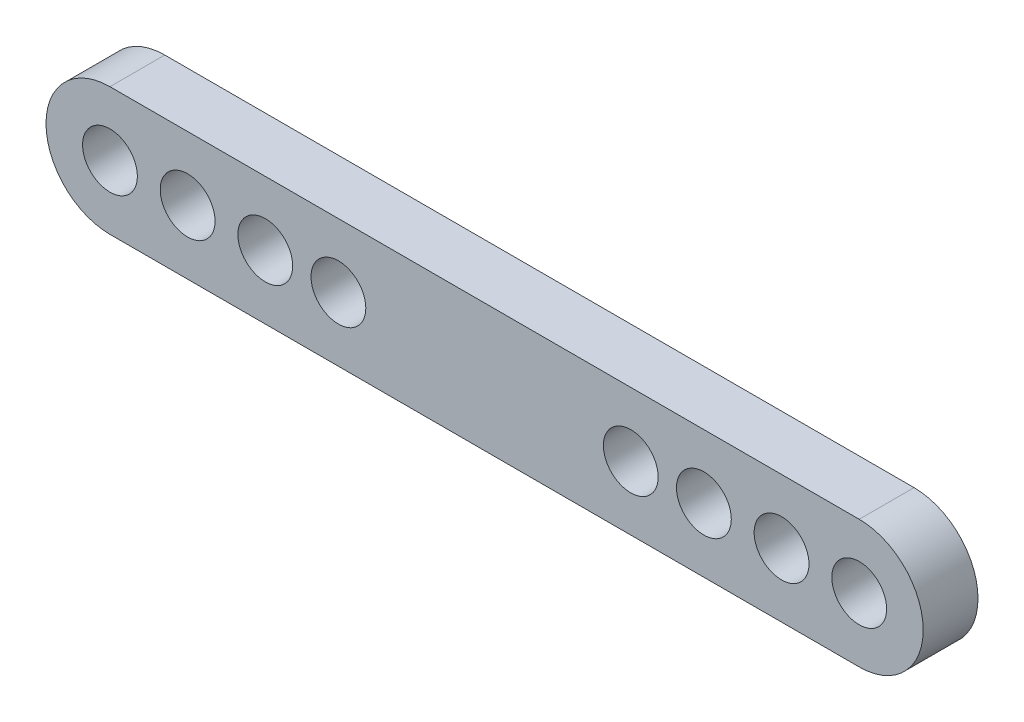
ISO-10303-21;
HEADER;
FILE_DESCRIPTION(('STEP AP214'),'2;1');
FILE_NAME('part.step','',(''),(''),'','','');
FILE_SCHEMA(('AUTOMOTIVE_DESIGN { 1 0 10303 214 1 1 1 1 }'));
ENDSEC;
DATA;
#1=APPLICATION_CONTEXT('core data for automotive mechanical design processes');
#2=APPLICATION_PROTOCOL_DEFINITION('international standard','automotive_design',2000,#1);
#3=PRODUCT_CONTEXT('',#1,'mechanical');
#4=PRODUCT('Part','Part','',(#3));
#5=PRODUCT_RELATED_PRODUCT_CATEGORY('part','',(#4));
#6=PRODUCT_DEFINITION_FORMATION('','',#4);
#7=PRODUCT_DEFINITION_CONTEXT('part definition',#1,'design');
#8=PRODUCT_DEFINITION('design','',#6,#7);
#9=PRODUCT_DEFINITION_SHAPE('','',#8);
#10=(LENGTH_UNIT() NAMED_UNIT(*) SI_UNIT(.MILLI.,.METRE.));
#11=(NAMED_UNIT(*) PLANE_ANGLE_UNIT() SI_UNIT($,.RADIAN.));
#12=(NAMED_UNIT(*) SI_UNIT($,.STERADIAN.) SOLID_ANGLE_UNIT());
#13=UNCERTAINTY_MEASURE_WITH_UNIT(LENGTH_MEASURE(1.E-05),#10,'distance_accuracy_value','');
#14=(GEOMETRIC_REPRESENTATION_CONTEXT(3) GLOBAL_UNCERTAINTY_ASSIGNED_CONTEXT((#13)) GLOBAL_UNIT_ASSIGNED_CONTEXT((#10,
#11,#12)) REPRESENTATION_CONTEXT('',''));
#15=CARTESIAN_POINT('',(0.,0.,0.));
#16=DIRECTION('',(0.,0.,1.));
#17=DIRECTION('',(1.,0.,0.));
#18=AXIS2_PLACEMENT_3D('',#15,#16,#17);
#19=CARTESIAN_POINT('',(-20.5,0.,3.));
#20=DIRECTION('',(0.,0.,-1.));
#21=DIRECTION('',(-1.,0.,0.));
#22=AXIS2_PLACEMENT_3D('',#19,#20,#21);
#23=PLANE('',#22);
#24=CARTESIAN_POINT('',(-20.5,0.,3.));
#25=DIRECTION('',(0.,0.,1.));
#26=DIRECTION('',(-1.,0.,0.));
#27=AXIS2_PLACEMENT_3D('',#24,#25,#26);
#28=CIRCLE('',#27,3.5);
#29=CARTESIAN_POINT('',(-20.5,3.5,3.));
#30=VERTEX_POINT('',#29);
#31=CARTESIAN_POINT('',(-20.5,-3.5,3.));
#32=VERTEX_POINT('',#31);
#33=EDGE_CURVE('E86',#30,#32,#28,.T.);
#34=ORIENTED_EDGE('',*,*,#33,.T.);
#35=DIRECTION('',(1.,0.,0.));
#36=VECTOR('',#35,1.);
#37=CARTESIAN_POINT('',(-20.5,-3.5,3.));
#38=LINE('',#37,#36);
#39=CARTESIAN_POINT('',(20.5,-3.49999999999999,3.));
#40=VERTEX_POINT('',#39);
#41=EDGE_CURVE('E81',#32,#40,#38,.T.);
#42=ORIENTED_EDGE('',*,*,#41,.T.);
#43=CARTESIAN_POINT('',(20.5,0.,3.));
#44=DIRECTION('',(0.,0.,1.));
#45=DIRECTION('',(1.,0.,0.));
#46=AXIS2_PLACEMENT_3D('',#43,#44,#45);
#47=CIRCLE('',#46,3.5);
#48=CARTESIAN_POINT('',(20.5,3.50000000000001,3.));
#49=VERTEX_POINT('',#48);
#50=EDGE_CURVE('E84',#40,#49,#47,.T.);
#51=ORIENTED_EDGE('',*,*,#50,.T.);
#52=DIRECTION('',(-1.,0.,0.));
#53=VECTOR('',#52,1.);
#54=CARTESIAN_POINT('',(-20.5,3.5,3.));
#55=LINE('',#54,#53);
#56=EDGE_CURVE('E51',#49,#30,#55,.T.);
#57=ORIENTED_EDGE('',*,*,#56,.T.);
#58=EDGE_LOOP('',(#34,#42,#51,#57));
#59=FACE_BOUND('',#58,.T.);
#60=CARTESIAN_POINT('',(-20.5,0.,3.));
#61=DIRECTION('',(0.,0.,1.));
#62=DIRECTION('',(1.,0.,0.));
#63=AXIS2_PLACEMENT_3D('',#60,#61,#62);
#64=CIRCLE('',#63,1.5);
#65=CARTESIAN_POINT('',(-19.,0.,3.));
#66=VERTEX_POINT('',#65);
#67=EDGE_CURVE('E101',#66,#66,#64,.T.);
#68=ORIENTED_EDGE('',*,*,#67,.F.);
#69=EDGE_LOOP('',(#68));
#70=FACE_BOUND('',#69,.T.);
#71=CARTESIAN_POINT('',(-16.25,0.,3.));
#72=DIRECTION('',(0.,0.,1.));
#73=DIRECTION('',(1.,0.,0.));
#74=AXIS2_PLACEMENT_3D('',#71,#72,#73);
#75=CIRCLE('',#74,1.5);
#76=CARTESIAN_POINT('',(-14.75,0.,3.));
#77=VERTEX_POINT('',#76);
#78=EDGE_CURVE('E116',#77,#77,#75,.T.);
#79=ORIENTED_EDGE('',*,*,#78,.F.);
#80=EDGE_LOOP('',(#79));
#81=FACE_BOUND('',#80,.T.);
#82=CARTESIAN_POINT('',(-12.,0.,3.));
#83=DIRECTION('',(0.,0.,1.));
#84=DIRECTION('',(1.,0.,0.));
#85=AXIS2_PLACEMENT_3D('',#82,#83,#84);
#86=CIRCLE('',#85,1.5);
#87=CARTESIAN_POINT('',(-10.5,0.,3.));
#88=VERTEX_POINT('',#87);
#89=EDGE_CURVE('E122',#88,#88,#86,.T.);
#90=ORIENTED_EDGE('',*,*,#89,.F.);
#91=EDGE_LOOP('',(#90));
#92=FACE_BOUND('',#91,.T.);
#93=CARTESIAN_POINT('',(-8.,0.,3.));
#94=DIRECTION('',(0.,0.,1.));
#95=DIRECTION('',(1.,0.,0.));
#96=AXIS2_PLACEMENT_3D('',#93,#94,#95);
#97=CIRCLE('',#96,1.5);
#98=CARTESIAN_POINT('',(-6.5,0.,3.));
#99=VERTEX_POINT('',#98);
#100=EDGE_CURVE('E128',#99,#99,#97,.T.);
#101=ORIENTED_EDGE('',*,*,#100,.F.);
#102=EDGE_LOOP('',(#101));
#103=FACE_BOUND('',#102,.T.);
#104=CARTESIAN_POINT('',(8.,0.,3.));
#105=DIRECTION('',(0.,0.,1.));
#106=DIRECTION('',(1.,0.,0.));
#107=AXIS2_PLACEMENT_3D('',#104,#105,#106);
#108=CIRCLE('',#107,1.5);
#109=CARTESIAN_POINT('',(9.50000000000001,0.,3.));
#110=VERTEX_POINT('',#109);
#111=EDGE_CURVE('E134',#110,#110,#108,.T.);
#112=ORIENTED_EDGE('',*,*,#111,.F.);
#113=EDGE_LOOP('',(#112));
#114=FACE_BOUND('',#113,.T.);
#115=CARTESIAN_POINT('',(12.,0.,3.));
#116=DIRECTION('',(0.,0.,1.));
#117=DIRECTION('',(1.,0.,0.));
#118=AXIS2_PLACEMENT_3D('',#115,#116,#117);
#119=CIRCLE('',#118,1.5);
#120=CARTESIAN_POINT('',(13.5,0.,3.));
#121=VERTEX_POINT('',#120);
#122=EDGE_CURVE('E140',#121,#121,#119,.T.);
#123=ORIENTED_EDGE('',*,*,#122,.F.);
#124=EDGE_LOOP('',(#123));
#125=FACE_BOUND('',#124,.T.);
#126=CARTESIAN_POINT('',(16.25,0.,3.));
#127=DIRECTION('',(0.,0.,1.));
#128=DIRECTION('',(1.,0.,0.));
#129=AXIS2_PLACEMENT_3D('',#126,#127,#128);
#130=CIRCLE('',#129,1.5);
#131=CARTESIAN_POINT('',(17.75,0.,3.));
#132=VERTEX_POINT('',#131);
#133=EDGE_CURVE('E146',#132,#132,#130,.T.);
#134=ORIENTED_EDGE('',*,*,#133,.F.);
#135=EDGE_LOOP('',(#134));
#136=FACE_BOUND('',#135,.T.);
#137=CARTESIAN_POINT('',(20.5,0.,3.));
#138=DIRECTION('',(0.,0.,1.));
#139=DIRECTION('',(1.,0.,0.));
#140=AXIS2_PLACEMENT_3D('',#137,#138,#139);
#141=CIRCLE('',#140,1.5);
#142=CARTESIAN_POINT('',(22.,0.,3.));
#143=VERTEX_POINT('',#142);
#144=EDGE_CURVE('E152',#143,#143,#141,.T.);
#145=ORIENTED_EDGE('',*,*,#144,.F.);
#146=EDGE_LOOP('',(#145));
#147=FACE_BOUND('',#146,.T.);
#148=ADVANCED_FACE('F34',(#59,#70,#81,#92,#103,#114,#125,#136,#147),#23,.F.);
#149=CARTESIAN_POINT('',(-20.5,0.,0.));
#150=DIRECTION('',(0.,0.,-1.));
#151=DIRECTION('',(-1.,0.,0.));
#152=AXIS2_PLACEMENT_3D('',#149,#150,#151);
#153=PLANE('',#152);
#154=CARTESIAN_POINT('',(16.25,0.,0.));
#155=DIRECTION('',(0.,0.,1.));
#156=DIRECTION('',(1.,0.,0.));
#157=AXIS2_PLACEMENT_3D('',#154,#155,#156);
#158=CIRCLE('',#157,1.5);
#159=CARTESIAN_POINT('',(17.75,0.,0.));
#160=VERTEX_POINT('',#159);
#161=EDGE_CURVE('E149',#160,#160,#158,.T.);
#162=ORIENTED_EDGE('',*,*,#161,.T.);
#163=EDGE_LOOP('',(#162));
#164=FACE_BOUND('',#163,.T.);
#165=CARTESIAN_POINT('',(8.,0.,0.));
#166=DIRECTION('',(0.,0.,1.));
#167=DIRECTION('',(1.,0.,0.));
#168=AXIS2_PLACEMENT_3D('',#165,#166,#167);
#169=CIRCLE('',#168,1.5);
#170=CARTESIAN_POINT('',(9.50000000000001,0.,0.));
#171=VERTEX_POINT('',#170);
#172=EDGE_CURVE('E137',#171,#171,#169,.T.);
#173=ORIENTED_EDGE('',*,*,#172,.T.);
#174=EDGE_LOOP('',(#173));
#175=FACE_BOUND('',#174,.T.);
#176=CARTESIAN_POINT('',(-12.,0.,0.));
#177=DIRECTION('',(0.,0.,1.));
#178=DIRECTION('',(1.,0.,0.));
#179=AXIS2_PLACEMENT_3D('',#176,#177,#178);
#180=CIRCLE('',#179,1.5);
#181=CARTESIAN_POINT('',(-10.5,0.,0.));
#182=VERTEX_POINT('',#181);
#183=EDGE_CURVE('E125',#182,#182,#180,.T.);
#184=ORIENTED_EDGE('',*,*,#183,.T.);
#185=EDGE_LOOP('',(#184));
#186=FACE_BOUND('',#185,.T.);
#187=CARTESIAN_POINT('',(-20.5,0.,0.));
#188=DIRECTION('',(0.,0.,1.));
#189=DIRECTION('',(1.,0.,0.));
#190=AXIS2_PLACEMENT_3D('',#187,#188,#189);
#191=CIRCLE('',#190,1.5);
#192=CARTESIAN_POINT('',(-19.,0.,0.));
#193=VERTEX_POINT('',#192);
#194=EDGE_CURVE('E113',#193,#193,#191,.T.);
#195=ORIENTED_EDGE('',*,*,#194,.T.);
#196=EDGE_LOOP('',(#195));
#197=FACE_BOUND('',#196,.T.);
#198=CARTESIAN_POINT('',(-20.5,0.,0.));
#199=DIRECTION('',(0.,0.,1.));
#200=DIRECTION('',(-1.,0.,0.));
#201=AXIS2_PLACEMENT_3D('',#198,#199,#200);
#202=CIRCLE('',#201,3.5);
#203=CARTESIAN_POINT('',(-20.5,3.5,0.));
#204=VERTEX_POINT('',#203);
#205=CARTESIAN_POINT('',(-20.5,-3.5,0.));
#206=VERTEX_POINT('',#205);
#207=EDGE_CURVE('E98',#204,#206,#202,.T.);
#208=ORIENTED_EDGE('',*,*,#207,.F.);
#209=DIRECTION('',(-1.,0.,0.));
#210=VECTOR('',#209,1.);
#211=CARTESIAN_POINT('',(-20.5,3.5,0.));
#212=LINE('',#211,#210);
#213=CARTESIAN_POINT('',(20.5,3.50000000000001,0.));
#214=VERTEX_POINT('',#213);
#215=EDGE_CURVE('E74',#214,#204,#212,.T.);
#216=ORIENTED_EDGE('',*,*,#215,.F.);
#217=CARTESIAN_POINT('',(20.5,0.,0.));
#218=DIRECTION('',(0.,0.,1.));
#219=DIRECTION('',(1.,0.,0.));
#220=AXIS2_PLACEMENT_3D('',#217,#218,#219);
#221=CIRCLE('',#220,3.5);
#222=CARTESIAN_POINT('',(20.5,-3.49999999999999,0.));
#223=VERTEX_POINT('',#222);
#224=EDGE_CURVE('E68',#223,#214,#221,.T.);
#225=ORIENTED_EDGE('',*,*,#224,.F.);
#226=DIRECTION('',(1.,0.,0.));
#227=VECTOR('',#226,1.);
#228=CARTESIAN_POINT('',(-20.5,-3.5,0.));
#229=LINE('',#228,#227);
#230=EDGE_CURVE('E90',#206,#223,#229,.T.);
#231=ORIENTED_EDGE('',*,*,#230,.F.);
#232=EDGE_LOOP('',(#208,#216,#225,#231));
#233=FACE_BOUND('',#232,.T.);
#234=CARTESIAN_POINT('',(-16.25,0.,0.));
#235=DIRECTION('',(0.,0.,1.));
#236=DIRECTION('',(1.,0.,0.));
#237=AXIS2_PLACEMENT_3D('',#234,#235,#236);
#238=CIRCLE('',#237,1.5);
#239=CARTESIAN_POINT('',(-14.75,0.,0.));
#240=VERTEX_POINT('',#239);
#241=EDGE_CURVE('E119',#240,#240,#238,.T.);
#242=ORIENTED_EDGE('',*,*,#241,.T.);
#243=EDGE_LOOP('',(#242));
#244=FACE_BOUND('',#243,.T.);
#245=CARTESIAN_POINT('',(-8.,0.,0.));
#246=DIRECTION('',(0.,0.,1.));
#247=DIRECTION('',(1.,0.,0.));
#248=AXIS2_PLACEMENT_3D('',#245,#246,#247);
#249=CIRCLE('',#248,1.5);
#250=CARTESIAN_POINT('',(-6.5,0.,0.));
#251=VERTEX_POINT('',#250);
#252=EDGE_CURVE('E131',#251,#251,#249,.T.);
#253=ORIENTED_EDGE('',*,*,#252,.T.);
#254=EDGE_LOOP('',(#253));
#255=FACE_BOUND('',#254,.T.);
#256=CARTESIAN_POINT('',(12.,0.,0.));
#257=DIRECTION('',(0.,0.,1.));
#258=DIRECTION('',(1.,0.,0.));
#259=AXIS2_PLACEMENT_3D('',#256,#257,#258);
#260=CIRCLE('',#259,1.5);
#261=CARTESIAN_POINT('',(13.5,0.,0.));
#262=VERTEX_POINT('',#261);
#263=EDGE_CURVE('E143',#262,#262,#260,.T.);
#264=ORIENTED_EDGE('',*,*,#263,.T.);
#265=EDGE_LOOP('',(#264));
#266=FACE_BOUND('',#265,.T.);
#267=CARTESIAN_POINT('',(20.5,0.,0.));
#268=DIRECTION('',(0.,0.,1.));
#269=DIRECTION('',(1.,0.,0.));
#270=AXIS2_PLACEMENT_3D('',#267,#268,#269);
#271=CIRCLE('',#270,1.5);
#272=CARTESIAN_POINT('',(22.,0.,0.));
#273=VERTEX_POINT('',#272);
#274=EDGE_CURVE('E155',#273,#273,#271,.T.);
#275=ORIENTED_EDGE('',*,*,#274,.T.);
#276=EDGE_LOOP('',(#275));
#277=FACE_BOUND('',#276,.T.);
#278=ADVANCED_FACE('F109',(#164,#175,#186,#197,#233,#244,#255,#266,#277),#153,.T.);
#279=CARTESIAN_POINT('',(-20.5,0.,3.));
#280=DIRECTION('',(0.,0.,-1.));
#281=DIRECTION('',(-1.,0.,0.));
#282=AXIS2_PLACEMENT_3D('',#279,#280,#281);
#283=CYLINDRICAL_SURFACE('',#282,3.5);
#284=ORIENTED_EDGE('',*,*,#207,.T.);
#285=DIRECTION('',(0.,0.,-1.));
#286=VECTOR('',#285,1.);
#287=CARTESIAN_POINT('',(-20.5,-3.5,3.));
#288=LINE('',#287,#286);
#289=EDGE_CURVE('E11',#32,#206,#288,.T.);
#290=ORIENTED_EDGE('',*,*,#289,.F.);
#291=ORIENTED_EDGE('',*,*,#33,.F.);
#292=DIRECTION('',(0.,0.,-1.));
#293=VECTOR('',#292,1.);
#294=CARTESIAN_POINT('',(-20.5,3.5,3.));
#295=LINE('',#294,#293);
#296=EDGE_CURVE('E94',#30,#204,#295,.T.);
#297=ORIENTED_EDGE('',*,*,#296,.T.);
#298=EDGE_LOOP('',(#284,#290,#291,#297));
#299=FACE_BOUND('',#298,.T.);
#300=ADVANCED_FACE('F36',(#299),#283,.T.);
#301=CARTESIAN_POINT('',(-20.5,-3.5,3.));
#302=DIRECTION('',(0.,1.,0.));
#303=DIRECTION('',(-1.,0.,0.));
#304=AXIS2_PLACEMENT_3D('',#301,#302,#303);
#305=PLANE('',#304);
#306=ORIENTED_EDGE('',*,*,#230,.T.);
#307=DIRECTION('',(0.,0.,-1.));
#308=VECTOR('',#307,1.);
#309=CARTESIAN_POINT('',(20.5,-3.49999999999999,3.));
#310=LINE('',#309,#308);
#311=EDGE_CURVE('E43',#40,#223,#310,.T.);
#312=ORIENTED_EDGE('',*,*,#311,.F.);
#313=ORIENTED_EDGE('',*,*,#41,.F.);
#314=ORIENTED_EDGE('',*,*,#289,.T.);
#315=EDGE_LOOP('',(#306,#312,#313,#314));
#316=FACE_BOUND('',#315,.T.);
#317=ADVANCED_FACE('F89',(#316),#305,.F.);
#318=CARTESIAN_POINT('',(20.5,0.,3.));
#319=DIRECTION('',(0.,0.,-1.));
#320=DIRECTION('',(-1.,0.,0.));
#321=AXIS2_PLACEMENT_3D('',#318,#319,#320);
#322=CYLINDRICAL_SURFACE('',#321,3.5);
#323=ORIENTED_EDGE('',*,*,#224,.T.);
#324=DIRECTION('',(0.,0.,-1.));
#325=VECTOR('',#324,1.);
#326=CARTESIAN_POINT('',(20.5,3.50000000000001,3.));
#327=LINE('',#326,#325);
#328=EDGE_CURVE('E91',#49,#214,#327,.T.);
#329=ORIENTED_EDGE('',*,*,#328,.F.);
#330=ORIENTED_EDGE('',*,*,#50,.F.);
#331=ORIENTED_EDGE('',*,*,#311,.T.);
#332=EDGE_LOOP('',(#323,#329,#330,#331));
#333=FACE_BOUND('',#332,.T.);
#334=ADVANCED_FACE('F92',(#333),#322,.T.);
#335=CARTESIAN_POINT('',(-20.5,3.5,3.));
#336=DIRECTION('',(0.,-1.,0.));
#337=DIRECTION('',(1.,0.,0.));
#338=AXIS2_PLACEMENT_3D('',#335,#336,#337);
#339=PLANE('',#338);
#340=ORIENTED_EDGE('',*,*,#215,.T.);
#341=ORIENTED_EDGE('',*,*,#296,.F.);
#342=ORIENTED_EDGE('',*,*,#56,.F.);
#343=ORIENTED_EDGE('',*,*,#328,.T.);
#344=EDGE_LOOP('',(#340,#341,#342,#343));
#345=FACE_BOUND('',#344,.T.);
#346=ADVANCED_FACE('F106',(#345),#339,.F.);
#347=CARTESIAN_POINT('',(-20.5,0.,3.));
#348=DIRECTION('',(0.,0.,-1.));
#349=DIRECTION('',(-1.,0.,0.));
#350=AXIS2_PLACEMENT_3D('',#347,#348,#349);
#351=CYLINDRICAL_SURFACE('',#350,1.5);
#352=ORIENTED_EDGE('',*,*,#67,.T.);
#353=EDGE_LOOP('',(#352));
#354=FACE_BOUND('',#353,.T.);
#355=ORIENTED_EDGE('',*,*,#194,.F.);
#356=EDGE_LOOP('',(#355));
#357=FACE_BOUND('',#356,.T.);
#358=ADVANCED_FACE('F172',(#354,#357),#351,.F.);
#359=CARTESIAN_POINT('',(-16.25,0.,3.));
#360=DIRECTION('',(0.,0.,-1.));
#361=DIRECTION('',(-1.,0.,0.));
#362=AXIS2_PLACEMENT_3D('',#359,#360,#361);
#363=CYLINDRICAL_SURFACE('',#362,1.5);
#364=ORIENTED_EDGE('',*,*,#78,.T.);
#365=EDGE_LOOP('',(#364));
#366=FACE_BOUND('',#365,.T.);
#367=ORIENTED_EDGE('',*,*,#241,.F.);
#368=EDGE_LOOP('',(#367));
#369=FACE_BOUND('',#368,.T.);
#370=ADVANCED_FACE('F218',(#366,#369),#363,.F.);
#371=CARTESIAN_POINT('',(-12.,0.,3.));
#372=DIRECTION('',(0.,0.,-1.));
#373=DIRECTION('',(-1.,0.,0.));
#374=AXIS2_PLACEMENT_3D('',#371,#372,#373);
#375=CYLINDRICAL_SURFACE('',#374,1.5);
#376=ORIENTED_EDGE('',*,*,#89,.T.);
#377=EDGE_LOOP('',(#376));
#378=FACE_BOUND('',#377,.T.);
#379=ORIENTED_EDGE('',*,*,#183,.F.);
#380=EDGE_LOOP('',(#379));
#381=FACE_BOUND('',#380,.T.);
#382=ADVANCED_FACE('F226',(#378,#381),#375,.F.);
#383=CARTESIAN_POINT('',(-8.,0.,3.));
#384=DIRECTION('',(0.,0.,-1.));
#385=DIRECTION('',(-1.,0.,0.));
#386=AXIS2_PLACEMENT_3D('',#383,#384,#385);
#387=CYLINDRICAL_SURFACE('',#386,1.5);
#388=ORIENTED_EDGE('',*,*,#100,.T.);
#389=EDGE_LOOP('',(#388));
#390=FACE_BOUND('',#389,.T.);
#391=ORIENTED_EDGE('',*,*,#252,.F.);
#392=EDGE_LOOP('',(#391));
#393=FACE_BOUND('',#392,.T.);
#394=ADVANCED_FACE('F234',(#390,#393),#387,.F.);
#395=CARTESIAN_POINT('',(8.,0.,3.));
#396=DIRECTION('',(0.,0.,-1.));
#397=DIRECTION('',(-1.,0.,0.));
#398=AXIS2_PLACEMENT_3D('',#395,#396,#397);
#399=CYLINDRICAL_SURFACE('',#398,1.5);
#400=ORIENTED_EDGE('',*,*,#111,.T.);
#401=EDGE_LOOP('',(#400));
#402=FACE_BOUND('',#401,.T.);
#403=ORIENTED_EDGE('',*,*,#172,.F.);
#404=EDGE_LOOP('',(#403));
#405=FACE_BOUND('',#404,.T.);
#406=ADVANCED_FACE('F243',(#402,#405),#399,.F.);
#407=CARTESIAN_POINT('',(12.,0.,3.));
#408=DIRECTION('',(0.,0.,-1.));
#409=DIRECTION('',(-1.,0.,0.));
#410=AXIS2_PLACEMENT_3D('',#407,#408,#409);
#411=CYLINDRICAL_SURFACE('',#410,1.5);
#412=ORIENTED_EDGE('',*,*,#122,.T.);
#413=EDGE_LOOP('',(#412));
#414=FACE_BOUND('',#413,.T.);
#415=ORIENTED_EDGE('',*,*,#263,.F.);
#416=EDGE_LOOP('',(#415));
#417=FACE_BOUND('',#416,.T.);
#418=ADVANCED_FACE('F252',(#414,#417),#411,.F.);
#419=CARTESIAN_POINT('',(16.25,0.,3.));
#420=DIRECTION('',(0.,0.,-1.));
#421=DIRECTION('',(-1.,0.,0.));
#422=AXIS2_PLACEMENT_3D('',#419,#420,#421);
#423=CYLINDRICAL_SURFACE('',#422,1.5);
#424=ORIENTED_EDGE('',*,*,#133,.T.);
#425=EDGE_LOOP('',(#424));
#426=FACE_BOUND('',#425,.T.);
#427=ORIENTED_EDGE('',*,*,#161,.F.);
#428=EDGE_LOOP('',(#427));
#429=FACE_BOUND('',#428,.T.);
#430=ADVANCED_FACE('F261',(#426,#429),#423,.F.);
#431=CARTESIAN_POINT('',(20.5,0.,3.));
#432=DIRECTION('',(0.,0.,-1.));
#433=DIRECTION('',(-1.,0.,0.));
#434=AXIS2_PLACEMENT_3D('',#431,#432,#433);
#435=CYLINDRICAL_SURFACE('',#434,1.5);
#436=ORIENTED_EDGE('',*,*,#144,.T.);
#437=EDGE_LOOP('',(#436));
#438=FACE_BOUND('',#437,.T.);
#439=ORIENTED_EDGE('',*,*,#274,.F.);
#440=EDGE_LOOP('',(#439));
#441=FACE_BOUND('',#440,.T.);
#442=ADVANCED_FACE('F161',(#438,#441),#435,.F.);
#443=CLOSED_SHELL('',(#148,#278,#300,#317,#334,#346,#358,#370,#382,#394,#406,#418,#430,#442));
#444=MANIFOLD_SOLID_BREP('B2',#443);
#445=ADVANCED_BREP_SHAPE_REPRESENTATION('',(#18,#444),#14);
#446=SHAPE_DEFINITION_REPRESENTATION(#9,#445);
ENDSEC;
END-ISO-10303-21;
